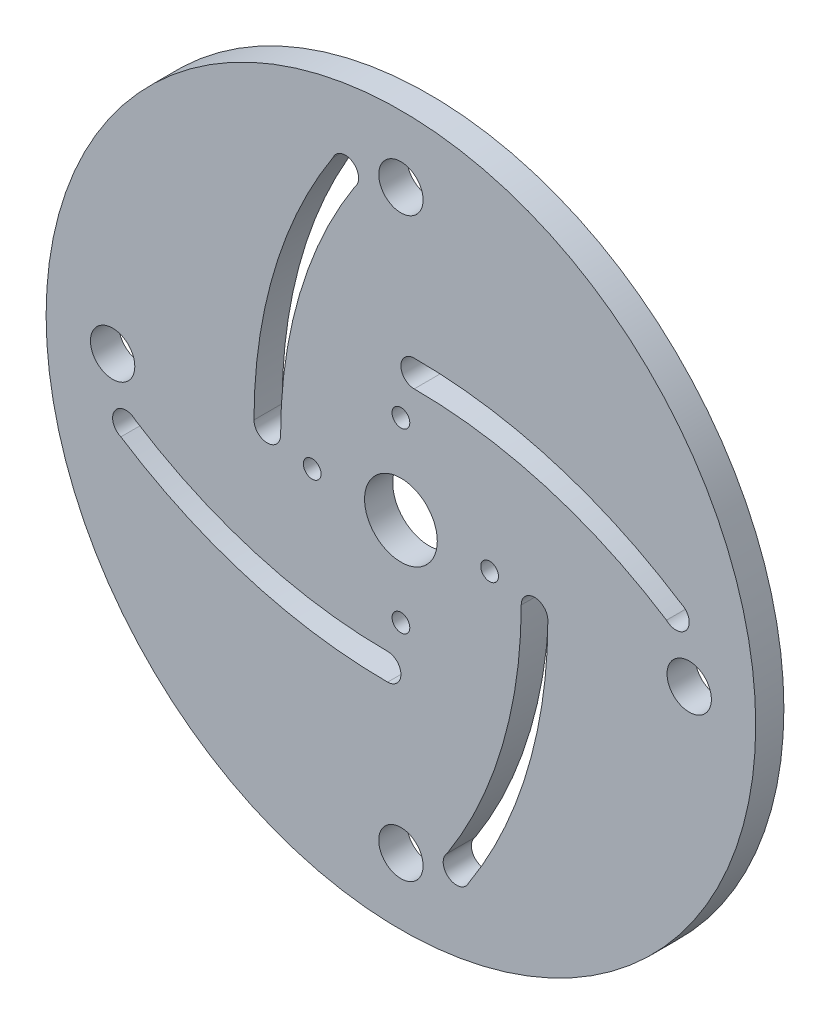
ISO-10303-21;
HEADER;
FILE_DESCRIPTION(('STEP AP214'),'2;1');
FILE_NAME('part.step','',(''),(''),'','','');
FILE_SCHEMA(('AUTOMOTIVE_DESIGN { 1 0 10303 214 1 1 1 1 }'));
ENDSEC;
DATA;
#1=APPLICATION_CONTEXT('core data for automotive mechanical design processes');
#2=APPLICATION_PROTOCOL_DEFINITION('international standard','automotive_design',2000,#1);
#3=PRODUCT_CONTEXT('',#1,'mechanical');
#4=PRODUCT('Part','Part','',(#3));
#5=PRODUCT_RELATED_PRODUCT_CATEGORY('part','',(#4));
#6=PRODUCT_DEFINITION_FORMATION('','',#4);
#7=PRODUCT_DEFINITION_CONTEXT('part definition',#1,'design');
#8=PRODUCT_DEFINITION('design','',#6,#7);
#9=PRODUCT_DEFINITION_SHAPE('','',#8);
#10=(LENGTH_UNIT() NAMED_UNIT(*) SI_UNIT(.MILLI.,.METRE.));
#11=(NAMED_UNIT(*) PLANE_ANGLE_UNIT() SI_UNIT($,.RADIAN.));
#12=(NAMED_UNIT(*) SI_UNIT($,.STERADIAN.) SOLID_ANGLE_UNIT());
#13=UNCERTAINTY_MEASURE_WITH_UNIT(LENGTH_MEASURE(1.E-05),#10,'distance_accuracy_value','');
#14=(GEOMETRIC_REPRESENTATION_CONTEXT(3) GLOBAL_UNCERTAINTY_ASSIGNED_CONTEXT((#13)) GLOBAL_UNIT_ASSIGNED_CONTEXT((#10,
#11,#12)) REPRESENTATION_CONTEXT('',''));
#15=CARTESIAN_POINT('',(0.,0.,0.));
#16=DIRECTION('',(0.,0.,1.));
#17=DIRECTION('',(1.,0.,0.));
#18=AXIS2_PLACEMENT_3D('',#15,#16,#17);
#19=CARTESIAN_POINT('',(0.,0.,3.175));
#20=DIRECTION('',(0.,0.,1.));
#21=DIRECTION('',(1.,0.,0.));
#22=AXIS2_PLACEMENT_3D('',#19,#20,#21);
#23=PLANE('',#22);
#24=CARTESIAN_POINT('',(-3.75211670479082E-13,-32.500000024,3.175));
#25=DIRECTION('',(0.,0.,1.));
#26=DIRECTION('',(1.,0.,0.));
#27=AXIS2_PLACEMENT_3D('',#24,#25,#26);
#28=CIRCLE('',#27,2.5);
#29=CARTESIAN_POINT('',(2.49999999999963,-32.500000024,3.175));
#30=VERTEX_POINT('',#29);
#31=EDGE_CURVE('E287',#30,#30,#28,.T.);
#32=ORIENTED_EDGE('',*,*,#31,.F.);
#33=EDGE_LOOP('',(#32));
#34=FACE_BOUND('',#33,.T.);
#35=CARTESIAN_POINT('',(0.,10.,3.175));
#36=DIRECTION('',(0.,0.,1.));
#37=DIRECTION('',(1.,0.,0.));
#38=AXIS2_PLACEMENT_3D('',#35,#36,#37);
#39=CIRCLE('',#38,1.);
#40=CARTESIAN_POINT('',(1.,10.,3.175));
#41=VERTEX_POINT('',#40);
#42=EDGE_CURVE('E299',#41,#41,#39,.T.);
#43=ORIENTED_EDGE('',*,*,#42,.F.);
#44=EDGE_LOOP('',(#43));
#45=FACE_BOUND('',#44,.T.);
#46=CARTESIAN_POINT('',(0.,-10.,3.175));
#47=DIRECTION('',(0.,0.,1.));
#48=DIRECTION('',(1.,0.,0.));
#49=AXIS2_PLACEMENT_3D('',#46,#47,#48);
#50=CIRCLE('',#49,1.);
#51=CARTESIAN_POINT('',(1.,-10.,3.175));
#52=VERTEX_POINT('',#51);
#53=EDGE_CURVE('E311',#52,#52,#50,.T.);
#54=ORIENTED_EDGE('',*,*,#53,.F.);
#55=EDGE_LOOP('',(#54));
#56=FACE_BOUND('',#55,.T.);
#57=CARTESIAN_POINT('',(10.,0.,3.175));
#58=DIRECTION('',(0.,0.,1.));
#59=DIRECTION('',(1.,0.,0.));
#60=AXIS2_PLACEMENT_3D('',#57,#58,#59);
#61=CIRCLE('',#60,1.);
#62=CARTESIAN_POINT('',(11.,0.,3.175));
#63=VERTEX_POINT('',#62);
#64=EDGE_CURVE('E323',#63,#63,#61,.T.);
#65=ORIENTED_EDGE('',*,*,#64,.F.);
#66=EDGE_LOOP('',(#65));
#67=FACE_BOUND('',#66,.T.);
#68=CARTESIAN_POINT('',(0.,0.,3.175));
#69=DIRECTION('',(0.,0.,1.));
#70=DIRECTION('',(1.,0.,0.));
#71=AXIS2_PLACEMENT_3D('',#68,#69,#70);
#72=CIRCLE('',#71,40.);
#73=CARTESIAN_POINT('',(40.,0.,3.175));
#74=VERTEX_POINT('',#73);
#75=EDGE_CURVE('E11',#74,#74,#72,.T.);
#76=ORIENTED_EDGE('',*,*,#75,.T.);
#77=EDGE_LOOP('',(#76));
#78=FACE_BOUND('',#77,.T.);
#79=CARTESIAN_POINT('',(0.,0.,3.175));
#80=DIRECTION('',(0.,0.,1.));
#81=DIRECTION('',(1.,0.,0.));
#82=AXIS2_PLACEMENT_3D('',#79,#80,#81);
#83=CIRCLE('',#82,4.1);
#84=CARTESIAN_POINT('',(4.1,0.,3.175));
#85=VERTEX_POINT('',#84);
#86=EDGE_CURVE('E329',#85,#85,#83,.T.);
#87=ORIENTED_EDGE('',*,*,#86,.F.);
#88=EDGE_LOOP('',(#87));
#89=FACE_BOUND('',#88,.T.);
#90=CARTESIAN_POINT('',(1.48265383286687E-13,32.500000024,3.175));
#91=DIRECTION('',(0.,0.,1.));
#92=DIRECTION('',(1.,0.,0.));
#93=AXIS2_PLACEMENT_3D('',#90,#91,#92);
#94=CIRCLE('',#93,2.5);
#95=CARTESIAN_POINT('',(2.50000000000015,32.500000024,3.175));
#96=VERTEX_POINT('',#95);
#97=EDGE_CURVE('E317',#96,#96,#94,.T.);
#98=ORIENTED_EDGE('',*,*,#97,.F.);
#99=EDGE_LOOP('',(#98));
#100=FACE_BOUND('',#99,.T.);
#101=CARTESIAN_POINT('',(-10.,0.,3.175));
#102=DIRECTION('',(0.,0.,1.));
#103=DIRECTION('',(1.,0.,0.));
#104=AXIS2_PLACEMENT_3D('',#101,#102,#103);
#105=CIRCLE('',#104,1.);
#106=CARTESIAN_POINT('',(-9.,0.,3.175));
#107=VERTEX_POINT('',#106);
#108=EDGE_CURVE('E305',#107,#107,#105,.T.);
#109=ORIENTED_EDGE('',*,*,#108,.F.);
#110=EDGE_LOOP('',(#109));
#111=FACE_BOUND('',#110,.T.);
#112=CARTESIAN_POINT('',(32.500000024,-2.68677420786791E-13,3.175));
#113=DIRECTION('',(0.,0.,1.));
#114=DIRECTION('',(1.,0.,0.));
#115=AXIS2_PLACEMENT_3D('',#112,#113,#114);
#116=CIRCLE('',#115,2.5);
#117=CARTESIAN_POINT('',(35.000000024,-2.68677420786791E-13,3.175));
#118=VERTEX_POINT('',#117);
#119=EDGE_CURVE('E293',#118,#118,#116,.T.);
#120=ORIENTED_EDGE('',*,*,#119,.F.);
#121=EDGE_LOOP('',(#120));
#122=FACE_BOUND('',#121,.T.);
#123=CARTESIAN_POINT('',(-32.500000024,4.88684814075279E-13,3.175));
#124=DIRECTION('',(0.,0.,1.));
#125=DIRECTION('',(1.,0.,0.));
#126=AXIS2_PLACEMENT_3D('',#123,#124,#125);
#127=CIRCLE('',#126,2.5);
#128=CARTESIAN_POINT('',(-30.000000024,4.88684814075279E-13,3.175));
#129=VERTEX_POINT('',#128);
#130=EDGE_CURVE('E281',#129,#129,#127,.T.);
#131=ORIENTED_EDGE('',*,*,#130,.F.);
#132=EDGE_LOOP('',(#131));
#133=FACE_BOUND('',#132,.T.);
#134=CARTESIAN_POINT('',(-39.0025216784097,-1.49999999999986,3.175));
#135=DIRECTION('',(0.,0.,-1.));
#136=DIRECTION('',(-1.,0.,0.));
#137=AXIS2_PLACEMENT_3D('',#134,#135,#136);
#138=CIRCLE('',#137,52.5665394608045);
#139=CARTESIAN_POINT('',(13.5640177823949,-1.50000000000004,3.175));
#140=VERTEX_POINT('',#139);
#141=CARTESIAN_POINT('',(5.20658394084292,-29.9393398522202,3.175));
#142=VERTEX_POINT('',#141);
#143=EDGE_CURVE('E252',#140,#142,#138,.T.);
#144=ORIENTED_EDGE('',*,*,#143,.F.);
#145=CARTESIAN_POINT('',(15.0640177823949,-1.50000000000005,3.175));
#146=DIRECTION('',(0.,0.,1.));
#147=DIRECTION('',(1.,0.,0.));
#148=AXIS2_PLACEMENT_3D('',#145,#146,#147);
#149=CIRCLE('',#148,1.5);
#150=CARTESIAN_POINT('',(16.5640177823949,-1.50000000000005,3.175));
#151=VERTEX_POINT('',#150);
#152=EDGE_CURVE('E250',#151,#140,#149,.T.);
#153=ORIENTED_EDGE('',*,*,#152,.F.);
#154=CARTESIAN_POINT('',(-38.6406245554937,-1.49999999999986,3.175));
#155=DIRECTION('',(0.,0.,1.));
#156=DIRECTION('',(-1.,0.,0.));
#157=AXIS2_PLACEMENT_3D('',#154,#155,#156);
#158=CIRCLE('',#157,55.2046423378886);
#159=CARTESIAN_POINT('',(7.65306341138967,-31.5740251725476,3.175));
#160=VERTEX_POINT('',#159);
#161=EDGE_CURVE('E258',#160,#151,#158,.T.);
#162=ORIENTED_EDGE('',*,*,#161,.F.);
#163=CARTESIAN_POINT('',(6.26724411262274,-31.000000024,3.175));
#164=DIRECTION('',(0.,0.,1.));
#165=DIRECTION('',(1.,0.,0.));
#166=AXIS2_PLACEMENT_3D('',#163,#164,#165);
#167=CIRCLE('',#166,1.5);
#168=EDGE_CURVE('E255',#142,#160,#167,.T.);
#169=ORIENTED_EDGE('',*,*,#168,.F.);
#170=EDGE_LOOP('',(#144,#153,#162,#169));
#171=FACE_BOUND('',#170,.T.);
#172=CARTESIAN_POINT('',(1.49999999999999,-39.0025216784097,3.175));
#173=DIRECTION('',(0.,0.,-1.));
#174=DIRECTION('',(-1.,0.,0.));
#175=AXIS2_PLACEMENT_3D('',#172,#173,#174);
#176=CIRCLE('',#175,52.5665394608045);
#177=CARTESIAN_POINT('',(1.49999999999999,13.5640177823949,3.175));
#178=VERTEX_POINT('',#177);
#179=CARTESIAN_POINT('',(29.9393398522202,5.20658394084302,3.175));
#180=VERTEX_POINT('',#179);
#181=EDGE_CURVE('E221',#178,#180,#176,.T.);
#182=ORIENTED_EDGE('',*,*,#181,.F.);
#183=CARTESIAN_POINT('',(1.5,15.0640177823949,3.175));
#184=DIRECTION('',(0.,0.,1.));
#185=DIRECTION('',(1.,0.,0.));
#186=AXIS2_PLACEMENT_3D('',#183,#184,#185);
#187=CIRCLE('',#186,1.5);
#188=CARTESIAN_POINT('',(1.49999999999999,16.5640177823949,3.175));
#189=VERTEX_POINT('',#188);
#190=EDGE_CURVE('E219',#189,#178,#187,.T.);
#191=ORIENTED_EDGE('',*,*,#190,.F.);
#192=CARTESIAN_POINT('',(1.49999999999999,-38.6406245554937,3.175));
#193=DIRECTION('',(0.,0.,1.));
#194=DIRECTION('',(-1.,0.,0.));
#195=AXIS2_PLACEMENT_3D('',#192,#193,#194);
#196=CIRCLE('',#195,55.2046423378886);
#197=CARTESIAN_POINT('',(31.5740251725476,7.65306341138978,3.175));
#198=VERTEX_POINT('',#197);
#199=EDGE_CURVE('E227',#198,#189,#196,.T.);
#200=ORIENTED_EDGE('',*,*,#199,.F.);
#201=CARTESIAN_POINT('',(31.000000024,6.26724411262285,3.175));
#202=DIRECTION('',(0.,0.,1.));
#203=DIRECTION('',(1.,0.,0.));
#204=AXIS2_PLACEMENT_3D('',#201,#202,#203);
#205=CIRCLE('',#204,1.5);
#206=EDGE_CURVE('E224',#180,#198,#205,.T.);
#207=ORIENTED_EDGE('',*,*,#206,.F.);
#208=EDGE_LOOP('',(#182,#191,#200,#207));
#209=FACE_BOUND('',#208,.T.);
#210=CARTESIAN_POINT('',(-1.49999999999972,39.0025216784097,3.175));
#211=DIRECTION('',(0.,0.,-1.));
#212=DIRECTION('',(-1.,0.,0.));
#213=AXIS2_PLACEMENT_3D('',#210,#211,#212);
#214=CIRCLE('',#213,52.5665394608045);
#215=CARTESIAN_POINT('',(-1.50000000000009,-13.5640177823949,3.175));
#216=VERTEX_POINT('',#215);
#217=CARTESIAN_POINT('',(-29.9393398522202,-5.20658394084281,3.175));
#218=VERTEX_POINT('',#217);
#219=EDGE_CURVE('E190',#216,#218,#214,.T.);
#220=ORIENTED_EDGE('',*,*,#219,.F.);
#221=CARTESIAN_POINT('',(-1.5000000000001,-15.0640177823949,3.175));
#222=DIRECTION('',(0.,0.,1.));
#223=DIRECTION('',(1.,0.,0.));
#224=AXIS2_PLACEMENT_3D('',#221,#222,#223);
#225=CIRCLE('',#224,1.5);
#226=CARTESIAN_POINT('',(-1.50000000000011,-16.5640177823949,3.175));
#227=VERTEX_POINT('',#226);
#228=EDGE_CURVE('E188',#227,#216,#225,.T.);
#229=ORIENTED_EDGE('',*,*,#228,.F.);
#230=CARTESIAN_POINT('',(-1.49999999999972,38.6406245554937,3.175));
#231=DIRECTION('',(0.,0.,1.));
#232=DIRECTION('',(-1.,0.,0.));
#233=AXIS2_PLACEMENT_3D('',#230,#231,#232);
#234=CIRCLE('',#233,55.2046423378886);
#235=CARTESIAN_POINT('',(-31.5740251725477,-7.65306341138955,3.175));
#236=VERTEX_POINT('',#235);
#237=EDGE_CURVE('E196',#236,#227,#234,.T.);
#238=ORIENTED_EDGE('',*,*,#237,.F.);
#239=CARTESIAN_POINT('',(-31.000000024,-6.26724411262263,3.175));
#240=DIRECTION('',(0.,0.,1.));
#241=DIRECTION('',(1.,0.,0.));
#242=AXIS2_PLACEMENT_3D('',#239,#240,#241);
#243=CIRCLE('',#242,1.5);
#244=EDGE_CURVE('E193',#218,#236,#243,.T.);
#245=ORIENTED_EDGE('',*,*,#244,.F.);
#246=EDGE_LOOP('',(#220,#229,#238,#245));
#247=FACE_BOUND('',#246,.T.);
#248=CARTESIAN_POINT('',(39.0025216784097,1.49999999999959,3.175));
#249=DIRECTION('',(0.,0.,-1.));
#250=DIRECTION('',(-1.,0.,0.));
#251=AXIS2_PLACEMENT_3D('',#248,#249,#250);
#252=CIRCLE('',#251,52.5665394608045);
#253=CARTESIAN_POINT('',(-13.5640177823948,1.50000000000014,3.175));
#254=VERTEX_POINT('',#253);
#255=CARTESIAN_POINT('',(-5.20658394084271,29.9393398522202,3.175));
#256=VERTEX_POINT('',#255);
#257=EDGE_CURVE('E160',#254,#256,#252,.T.);
#258=ORIENTED_EDGE('',*,*,#257,.F.);
#259=CARTESIAN_POINT('',(-15.0640177823949,1.50000000000015,3.175));
#260=DIRECTION('',(0.,0.,1.));
#261=DIRECTION('',(1.,0.,0.));
#262=AXIS2_PLACEMENT_3D('',#259,#260,#261);
#263=CIRCLE('',#262,1.5);
#264=CARTESIAN_POINT('',(-16.5640177823949,1.50000000000017,3.175));
#265=VERTEX_POINT('',#264);
#266=EDGE_CURVE('E152',#265,#254,#263,.T.);
#267=ORIENTED_EDGE('',*,*,#266,.F.);
#268=CARTESIAN_POINT('',(38.6406245554937,1.49999999999959,3.175));
#269=DIRECTION('',(0.,0.,1.));
#270=DIRECTION('',(-1.,0.,0.));
#271=AXIS2_PLACEMENT_3D('',#268,#269,#270);
#272=CIRCLE('',#271,55.2046423378886);
#273=CARTESIAN_POINT('',(-7.65306341138944,31.5740251725477,3.175));
#274=VERTEX_POINT('',#273);
#275=EDGE_CURVE('E174',#274,#265,#272,.T.);
#276=ORIENTED_EDGE('',*,*,#275,.F.);
#277=CARTESIAN_POINT('',(-6.26724411262253,31.0000000240001,3.175));
#278=DIRECTION('',(0.,0.,1.));
#279=DIRECTION('',(1.,0.,0.));
#280=AXIS2_PLACEMENT_3D('',#277,#278,#279);
#281=CIRCLE('',#280,1.5);
#282=EDGE_CURVE('E172',#256,#274,#281,.T.);
#283=ORIENTED_EDGE('',*,*,#282,.F.);
#284=EDGE_LOOP('',(#258,#267,#276,#283));
#285=FACE_BOUND('',#284,.T.);
#286=ADVANCED_FACE('F39',(#34,#45,#56,#67,#78,#89,#100,#111,#122,#133,#171,#209,#247,#285),#23,.T.);
#287=CARTESIAN_POINT('',(0.,0.,0.));
#288=DIRECTION('',(0.,0.,1.));
#289=DIRECTION('',(1.,0.,0.));
#290=AXIS2_PLACEMENT_3D('',#287,#288,#289);
#291=PLANE('',#290);
#292=CARTESIAN_POINT('',(-1.5000000000001,-15.0640177823949,0.));
#293=DIRECTION('',(0.,0.,1.));
#294=DIRECTION('',(1.,0.,0.));
#295=AXIS2_PLACEMENT_3D('',#292,#293,#294);
#296=CIRCLE('',#295,1.5);
#297=CARTESIAN_POINT('',(-1.50000000000011,-16.5640177823949,0.));
#298=VERTEX_POINT('',#297);
#299=CARTESIAN_POINT('',(-1.50000000000009,-13.5640177823949,0.));
#300=VERTEX_POINT('',#299);
#301=EDGE_CURVE('E168',#298,#300,#296,.T.);
#302=ORIENTED_EDGE('',*,*,#301,.T.);
#303=CARTESIAN_POINT('',(-1.49999999999972,39.0025216784097,0.));
#304=DIRECTION('',(0.,0.,-1.));
#305=DIRECTION('',(-1.,0.,0.));
#306=AXIS2_PLACEMENT_3D('',#303,#304,#305);
#307=CIRCLE('',#306,52.5665394608045);
#308=CARTESIAN_POINT('',(-29.9393398522202,-5.20658394084281,0.));
#309=VERTEX_POINT('',#308);
#310=EDGE_CURVE('E201',#300,#309,#307,.T.);
#311=ORIENTED_EDGE('',*,*,#310,.T.);
#312=CARTESIAN_POINT('',(-31.000000024,-6.26724411262263,0.));
#313=DIRECTION('',(0.,0.,1.));
#314=DIRECTION('',(1.,0.,0.));
#315=AXIS2_PLACEMENT_3D('',#312,#313,#314);
#316=CIRCLE('',#315,1.5);
#317=CARTESIAN_POINT('',(-31.5740251725477,-7.65306341138956,0.));
#318=VERTEX_POINT('',#317);
#319=EDGE_CURVE('E204',#309,#318,#316,.T.);
#320=ORIENTED_EDGE('',*,*,#319,.T.);
#321=CARTESIAN_POINT('',(-1.49999999999972,38.6406245554937,0.));
#322=DIRECTION('',(0.,0.,1.));
#323=DIRECTION('',(-1.,0.,0.));
#324=AXIS2_PLACEMENT_3D('',#321,#322,#323);
#325=CIRCLE('',#324,55.2046423378886);
#326=EDGE_CURVE('E191',#318,#298,#325,.T.);
#327=ORIENTED_EDGE('',*,*,#326,.T.);
#328=EDGE_LOOP('',(#302,#311,#320,#327));
#329=FACE_BOUND('',#328,.T.);
#330=CARTESIAN_POINT('',(15.0640177823949,-1.50000000000005,0.));
#331=DIRECTION('',(0.,0.,1.));
#332=DIRECTION('',(1.,0.,0.));
#333=AXIS2_PLACEMENT_3D('',#330,#331,#332);
#334=CIRCLE('',#333,1.5);
#335=CARTESIAN_POINT('',(16.5640177823949,-1.49999999999986,0.));
#336=VERTEX_POINT('',#335);
#337=CARTESIAN_POINT('',(13.5640177823949,-1.50000000000004,0.));
#338=VERTEX_POINT('',#337);
#339=EDGE_CURVE('E249',#336,#338,#334,.T.);
#340=ORIENTED_EDGE('',*,*,#339,.T.);
#341=CARTESIAN_POINT('',(-39.0025216784097,-1.49999999999986,0.));
#342=DIRECTION('',(0.,0.,-1.));
#343=DIRECTION('',(-1.,0.,0.));
#344=AXIS2_PLACEMENT_3D('',#341,#342,#343);
#345=CIRCLE('',#344,52.5665394608045);
#346=CARTESIAN_POINT('',(5.20658394084292,-29.9393398522202,0.));
#347=VERTEX_POINT('',#346);
#348=EDGE_CURVE('E263',#338,#347,#345,.T.);
#349=ORIENTED_EDGE('',*,*,#348,.T.);
#350=CARTESIAN_POINT('',(6.26724411262274,-31.000000024,0.));
#351=DIRECTION('',(0.,0.,1.));
#352=DIRECTION('',(1.,0.,0.));
#353=AXIS2_PLACEMENT_3D('',#350,#351,#352);
#354=CIRCLE('',#353,1.5);
#355=CARTESIAN_POINT('',(7.65306341138967,-31.5740251725476,0.));
#356=VERTEX_POINT('',#355);
#357=EDGE_CURVE('E266',#347,#356,#354,.T.);
#358=ORIENTED_EDGE('',*,*,#357,.T.);
#359=CARTESIAN_POINT('',(-38.6406245554937,-1.49999999999986,0.));
#360=DIRECTION('',(0.,0.,1.));
#361=DIRECTION('',(-1.,0.,0.));
#362=AXIS2_PLACEMENT_3D('',#359,#360,#361);
#363=CIRCLE('',#362,55.2046423378886);
#364=EDGE_CURVE('E253',#356,#336,#363,.T.);
#365=ORIENTED_EDGE('',*,*,#364,.T.);
#366=EDGE_LOOP('',(#340,#349,#358,#365));
#367=FACE_BOUND('',#366,.T.);
#368=CARTESIAN_POINT('',(0.,0.,0.));
#369=DIRECTION('',(0.,0.,1.));
#370=DIRECTION('',(1.,0.,0.));
#371=AXIS2_PLACEMENT_3D('',#368,#369,#370);
#372=CIRCLE('',#371,40.);
#373=CARTESIAN_POINT('',(40.,0.,0.));
#374=VERTEX_POINT('',#373);
#375=EDGE_CURVE('E43',#374,#374,#372,.T.);
#376=ORIENTED_EDGE('',*,*,#375,.F.);
#377=EDGE_LOOP('',(#376));
#378=FACE_BOUND('',#377,.T.);
#379=CARTESIAN_POINT('',(0.,0.,0.));
#380=DIRECTION('',(0.,0.,1.));
#381=DIRECTION('',(1.,0.,0.));
#382=AXIS2_PLACEMENT_3D('',#379,#380,#381);
#383=CIRCLE('',#382,4.1);
#384=CARTESIAN_POINT('',(4.1,0.,0.));
#385=VERTEX_POINT('',#384);
#386=EDGE_CURVE('E326',#385,#385,#383,.T.);
#387=ORIENTED_EDGE('',*,*,#386,.T.);
#388=EDGE_LOOP('',(#387));
#389=FACE_BOUND('',#388,.T.);
#390=CARTESIAN_POINT('',(10.,0.,0.));
#391=DIRECTION('',(0.,0.,1.));
#392=DIRECTION('',(1.,0.,0.));
#393=AXIS2_PLACEMENT_3D('',#390,#391,#392);
#394=CIRCLE('',#393,1.);
#395=CARTESIAN_POINT('',(11.,0.,0.));
#396=VERTEX_POINT('',#395);
#397=EDGE_CURVE('E320',#396,#396,#394,.T.);
#398=ORIENTED_EDGE('',*,*,#397,.T.);
#399=EDGE_LOOP('',(#398));
#400=FACE_BOUND('',#399,.T.);
#401=CARTESIAN_POINT('',(1.48265383286687E-13,32.500000024,0.));
#402=DIRECTION('',(0.,0.,1.));
#403=DIRECTION('',(1.,0.,0.));
#404=AXIS2_PLACEMENT_3D('',#401,#402,#403);
#405=CIRCLE('',#404,2.5);
#406=CARTESIAN_POINT('',(2.50000000000015,32.500000024,0.));
#407=VERTEX_POINT('',#406);
#408=EDGE_CURVE('E314',#407,#407,#405,.T.);
#409=ORIENTED_EDGE('',*,*,#408,.T.);
#410=EDGE_LOOP('',(#409));
#411=FACE_BOUND('',#410,.T.);
#412=CARTESIAN_POINT('',(0.,-10.,0.));
#413=DIRECTION('',(0.,0.,1.));
#414=DIRECTION('',(1.,0.,0.));
#415=AXIS2_PLACEMENT_3D('',#412,#413,#414);
#416=CIRCLE('',#415,1.);
#417=CARTESIAN_POINT('',(1.,-10.,0.));
#418=VERTEX_POINT('',#417);
#419=EDGE_CURVE('E308',#418,#418,#416,.T.);
#420=ORIENTED_EDGE('',*,*,#419,.T.);
#421=EDGE_LOOP('',(#420));
#422=FACE_BOUND('',#421,.T.);
#423=CARTESIAN_POINT('',(-10.,0.,0.));
#424=DIRECTION('',(0.,0.,1.));
#425=DIRECTION('',(1.,0.,0.));
#426=AXIS2_PLACEMENT_3D('',#423,#424,#425);
#427=CIRCLE('',#426,1.);
#428=CARTESIAN_POINT('',(-9.,0.,0.));
#429=VERTEX_POINT('',#428);
#430=EDGE_CURVE('E302',#429,#429,#427,.T.);
#431=ORIENTED_EDGE('',*,*,#430,.T.);
#432=EDGE_LOOP('',(#431));
#433=FACE_BOUND('',#432,.T.);
#434=CARTESIAN_POINT('',(0.,10.,0.));
#435=DIRECTION('',(0.,0.,1.));
#436=DIRECTION('',(1.,0.,0.));
#437=AXIS2_PLACEMENT_3D('',#434,#435,#436);
#438=CIRCLE('',#437,1.);
#439=CARTESIAN_POINT('',(1.,10.,0.));
#440=VERTEX_POINT('',#439);
#441=EDGE_CURVE('E296',#440,#440,#438,.T.);
#442=ORIENTED_EDGE('',*,*,#441,.T.);
#443=EDGE_LOOP('',(#442));
#444=FACE_BOUND('',#443,.T.);
#445=CARTESIAN_POINT('',(32.500000024,-2.68677420786791E-13,0.));
#446=DIRECTION('',(0.,0.,1.));
#447=DIRECTION('',(1.,0.,0.));
#448=AXIS2_PLACEMENT_3D('',#445,#446,#447);
#449=CIRCLE('',#448,2.5);
#450=CARTESIAN_POINT('',(35.000000024,-2.68677420786791E-13,0.));
#451=VERTEX_POINT('',#450);
#452=EDGE_CURVE('E290',#451,#451,#449,.T.);
#453=ORIENTED_EDGE('',*,*,#452,.T.);
#454=EDGE_LOOP('',(#453));
#455=FACE_BOUND('',#454,.T.);
#456=CARTESIAN_POINT('',(-3.75211670479082E-13,-32.500000024,0.));
#457=DIRECTION('',(0.,0.,1.));
#458=DIRECTION('',(1.,0.,0.));
#459=AXIS2_PLACEMENT_3D('',#456,#457,#458);
#460=CIRCLE('',#459,2.5);
#461=CARTESIAN_POINT('',(2.49999999999963,-32.500000024,0.));
#462=VERTEX_POINT('',#461);
#463=EDGE_CURVE('E284',#462,#462,#460,.T.);
#464=ORIENTED_EDGE('',*,*,#463,.T.);
#465=EDGE_LOOP('',(#464));
#466=FACE_BOUND('',#465,.T.);
#467=CARTESIAN_POINT('',(-32.500000024,4.88684814075279E-13,0.));
#468=DIRECTION('',(0.,0.,1.));
#469=DIRECTION('',(1.,0.,0.));
#470=AXIS2_PLACEMENT_3D('',#467,#468,#469);
#471=CIRCLE('',#470,2.5);
#472=CARTESIAN_POINT('',(-30.000000024,4.88684814075279E-13,0.));
#473=VERTEX_POINT('',#472);
#474=EDGE_CURVE('E280',#473,#473,#471,.T.);
#475=ORIENTED_EDGE('',*,*,#474,.T.);
#476=EDGE_LOOP('',(#475));
#477=FACE_BOUND('',#476,.T.);
#478=CARTESIAN_POINT('',(1.5,15.0640177823949,0.));
#479=DIRECTION('',(0.,0.,1.));
#480=DIRECTION('',(1.,0.,0.));
#481=AXIS2_PLACEMENT_3D('',#478,#479,#480);
#482=CIRCLE('',#481,1.5);
#483=CARTESIAN_POINT('',(1.49999999999999,16.5640177823949,0.));
#484=VERTEX_POINT('',#483);
#485=CARTESIAN_POINT('',(1.49999999999999,13.5640177823949,0.));
#486=VERTEX_POINT('',#485);
#487=EDGE_CURVE('E218',#484,#486,#482,.T.);
#488=ORIENTED_EDGE('',*,*,#487,.T.);
#489=CARTESIAN_POINT('',(1.49999999999999,-39.0025216784097,0.));
#490=DIRECTION('',(0.,0.,-1.));
#491=DIRECTION('',(-1.,0.,0.));
#492=AXIS2_PLACEMENT_3D('',#489,#490,#491);
#493=CIRCLE('',#492,52.5665394608045);
#494=CARTESIAN_POINT('',(29.9393398522202,5.20658394084302,0.));
#495=VERTEX_POINT('',#494);
#496=EDGE_CURVE('E232',#486,#495,#493,.T.);
#497=ORIENTED_EDGE('',*,*,#496,.T.);
#498=CARTESIAN_POINT('',(31.000000024,6.26724411262285,0.));
#499=DIRECTION('',(0.,0.,1.));
#500=DIRECTION('',(1.,0.,0.));
#501=AXIS2_PLACEMENT_3D('',#498,#499,#500);
#502=CIRCLE('',#501,1.5);
#503=CARTESIAN_POINT('',(31.5740251725476,7.65306341138978,0.));
#504=VERTEX_POINT('',#503);
#505=EDGE_CURVE('E235',#495,#504,#502,.T.);
#506=ORIENTED_EDGE('',*,*,#505,.T.);
#507=CARTESIAN_POINT('',(1.49999999999999,-38.6406245554937,0.));
#508=DIRECTION('',(0.,0.,1.));
#509=DIRECTION('',(-1.,0.,0.));
#510=AXIS2_PLACEMENT_3D('',#507,#508,#509);
#511=CIRCLE('',#510,55.2046423378886);
#512=EDGE_CURVE('E222',#504,#484,#511,.T.);
#513=ORIENTED_EDGE('',*,*,#512,.T.);
#514=EDGE_LOOP('',(#488,#497,#506,#513));
#515=FACE_BOUND('',#514,.T.);
#516=CARTESIAN_POINT('',(-15.0640177823949,1.50000000000015,0.));
#517=DIRECTION('',(0.,0.,1.));
#518=DIRECTION('',(1.,0.,0.));
#519=AXIS2_PLACEMENT_3D('',#516,#517,#518);
#520=CIRCLE('',#519,1.5);
#521=CARTESIAN_POINT('',(-16.5640177823949,1.50000000000017,0.));
#522=VERTEX_POINT('',#521);
#523=CARTESIAN_POINT('',(-13.5640177823948,1.50000000000014,0.));
#524=VERTEX_POINT('',#523);
#525=EDGE_CURVE('E62',#522,#524,#520,.T.);
#526=ORIENTED_EDGE('',*,*,#525,.T.);
#527=CARTESIAN_POINT('',(39.0025216784097,1.49999999999959,0.));
#528=DIRECTION('',(0.,0.,-1.));
#529=DIRECTION('',(-1.,0.,0.));
#530=AXIS2_PLACEMENT_3D('',#527,#528,#529);
#531=CIRCLE('',#530,52.5665394608045);
#532=CARTESIAN_POINT('',(-5.20658394084271,29.9393398522202,0.));
#533=VERTEX_POINT('',#532);
#534=EDGE_CURVE('E167',#524,#533,#531,.T.);
#535=ORIENTED_EDGE('',*,*,#534,.T.);
#536=CARTESIAN_POINT('',(-6.26724411262253,31.0000000240001,0.));
#537=DIRECTION('',(0.,0.,1.));
#538=DIRECTION('',(1.,0.,0.));
#539=AXIS2_PLACEMENT_3D('',#536,#537,#538);
#540=CIRCLE('',#539,1.5);
#541=CARTESIAN_POINT('',(-7.65306341138944,31.5740251725477,0.));
#542=VERTEX_POINT('',#541);
#543=EDGE_CURVE('E180',#533,#542,#540,.T.);
#544=ORIENTED_EDGE('',*,*,#543,.T.);
#545=CARTESIAN_POINT('',(38.6406245554937,1.49999999999959,0.));
#546=DIRECTION('',(0.,0.,1.));
#547=DIRECTION('',(-1.,0.,0.));
#548=AXIS2_PLACEMENT_3D('',#545,#546,#547);
#549=CIRCLE('',#548,55.2046423378886);
#550=EDGE_CURVE('E161',#542,#522,#549,.T.);
#551=ORIENTED_EDGE('',*,*,#550,.T.);
#552=EDGE_LOOP('',(#526,#535,#544,#551));
#553=FACE_BOUND('',#552,.T.);
#554=ADVANCED_FACE('F335',(#329,#367,#378,#389,#400,#411,#422,#433,#444,#455,#466,#477,#515,
#553),#291,.F.);
#555=CARTESIAN_POINT('',(0.,0.,3.175));
#556=DIRECTION('',(0.,0.,-1.));
#557=DIRECTION('',(-1.,0.,0.));
#558=AXIS2_PLACEMENT_3D('',#555,#556,#557);
#559=CYLINDRICAL_SURFACE('',#558,40.);
#560=ORIENTED_EDGE('',*,*,#75,.F.);
#561=EDGE_LOOP('',(#560));
#562=FACE_BOUND('',#561,.T.);
#563=ORIENTED_EDGE('',*,*,#375,.T.);
#564=EDGE_LOOP('',(#563));
#565=FACE_BOUND('',#564,.T.);
#566=ADVANCED_FACE('F41',(#562,#565),#559,.T.);
#567=CARTESIAN_POINT('',(0.,0.,3.175));
#568=DIRECTION('',(0.,0.,-1.));
#569=DIRECTION('',(-1.,0.,0.));
#570=AXIS2_PLACEMENT_3D('',#567,#568,#569);
#571=CYLINDRICAL_SURFACE('',#570,4.1);
#572=ORIENTED_EDGE('',*,*,#86,.T.);
#573=EDGE_LOOP('',(#572));
#574=FACE_BOUND('',#573,.T.);
#575=ORIENTED_EDGE('',*,*,#386,.F.);
#576=EDGE_LOOP('',(#575));
#577=FACE_BOUND('',#576,.T.);
#578=ADVANCED_FACE('F338',(#574,#577),#571,.F.);
#579=CARTESIAN_POINT('',(10.,0.,3.175));
#580=DIRECTION('',(0.,0.,-1.));
#581=DIRECTION('',(-1.,0.,0.));
#582=AXIS2_PLACEMENT_3D('',#579,#580,#581);
#583=CYLINDRICAL_SURFACE('',#582,1.);
#584=ORIENTED_EDGE('',*,*,#64,.T.);
#585=EDGE_LOOP('',(#584));
#586=FACE_BOUND('',#585,.T.);
#587=ORIENTED_EDGE('',*,*,#397,.F.);
#588=EDGE_LOOP('',(#587));
#589=FACE_BOUND('',#588,.T.);
#590=ADVANCED_FACE('F340',(#586,#589),#583,.F.);
#591=CARTESIAN_POINT('',(1.48265383286687E-13,32.500000024,3.175));
#592=DIRECTION('',(0.,0.,-1.));
#593=DIRECTION('',(-1.,0.,0.));
#594=AXIS2_PLACEMENT_3D('',#591,#592,#593);
#595=CYLINDRICAL_SURFACE('',#594,2.5);
#596=ORIENTED_EDGE('',*,*,#97,.T.);
#597=EDGE_LOOP('',(#596));
#598=FACE_BOUND('',#597,.T.);
#599=ORIENTED_EDGE('',*,*,#408,.F.);
#600=EDGE_LOOP('',(#599));
#601=FACE_BOUND('',#600,.T.);
#602=ADVANCED_FACE('F347',(#598,#601),#595,.F.);
#603=CARTESIAN_POINT('',(0.,-10.,3.175));
#604=DIRECTION('',(0.,0.,-1.));
#605=DIRECTION('',(-1.,0.,0.));
#606=AXIS2_PLACEMENT_3D('',#603,#604,#605);
#607=CYLINDRICAL_SURFACE('',#606,1.);
#608=ORIENTED_EDGE('',*,*,#53,.T.);
#609=EDGE_LOOP('',(#608));
#610=FACE_BOUND('',#609,.T.);
#611=ORIENTED_EDGE('',*,*,#419,.F.);
#612=EDGE_LOOP('',(#611));
#613=FACE_BOUND('',#612,.T.);
#614=ADVANCED_FACE('F469',(#610,#613),#607,.F.);
#615=CARTESIAN_POINT('',(-10.,0.,3.175));
#616=DIRECTION('',(0.,0.,-1.));
#617=DIRECTION('',(-1.,0.,0.));
#618=AXIS2_PLACEMENT_3D('',#615,#616,#617);
#619=CYLINDRICAL_SURFACE('',#618,1.);
#620=ORIENTED_EDGE('',*,*,#108,.T.);
#621=EDGE_LOOP('',(#620));
#622=FACE_BOUND('',#621,.T.);
#623=ORIENTED_EDGE('',*,*,#430,.F.);
#624=EDGE_LOOP('',(#623));
#625=FACE_BOUND('',#624,.T.);
#626=ADVANCED_FACE('F465',(#622,#625),#619,.F.);
#627=CARTESIAN_POINT('',(0.,10.,3.175));
#628=DIRECTION('',(0.,0.,-1.));
#629=DIRECTION('',(-1.,0.,0.));
#630=AXIS2_PLACEMENT_3D('',#627,#628,#629);
#631=CYLINDRICAL_SURFACE('',#630,1.);
#632=ORIENTED_EDGE('',*,*,#42,.T.);
#633=EDGE_LOOP('',(#632));
#634=FACE_BOUND('',#633,.T.);
#635=ORIENTED_EDGE('',*,*,#441,.F.);
#636=EDGE_LOOP('',(#635));
#637=FACE_BOUND('',#636,.T.);
#638=ADVANCED_FACE('F461',(#634,#637),#631,.F.);
#639=CARTESIAN_POINT('',(32.500000024,-2.68677420786791E-13,3.175));
#640=DIRECTION('',(0.,0.,-1.));
#641=DIRECTION('',(-1.,0.,0.));
#642=AXIS2_PLACEMENT_3D('',#639,#640,#641);
#643=CYLINDRICAL_SURFACE('',#642,2.5);
#644=ORIENTED_EDGE('',*,*,#119,.T.);
#645=EDGE_LOOP('',(#644));
#646=FACE_BOUND('',#645,.T.);
#647=ORIENTED_EDGE('',*,*,#452,.F.);
#648=EDGE_LOOP('',(#647));
#649=FACE_BOUND('',#648,.T.);
#650=ADVANCED_FACE('F457',(#646,#649),#643,.F.);
#651=CARTESIAN_POINT('',(-3.75211670479082E-13,-32.500000024,3.175));
#652=DIRECTION('',(0.,0.,-1.));
#653=DIRECTION('',(-1.,0.,0.));
#654=AXIS2_PLACEMENT_3D('',#651,#652,#653);
#655=CYLINDRICAL_SURFACE('',#654,2.5);
#656=ORIENTED_EDGE('',*,*,#31,.T.);
#657=EDGE_LOOP('',(#656));
#658=FACE_BOUND('',#657,.T.);
#659=ORIENTED_EDGE('',*,*,#463,.F.);
#660=EDGE_LOOP('',(#659));
#661=FACE_BOUND('',#660,.T.);
#662=ADVANCED_FACE('F453',(#658,#661),#655,.F.);
#663=CARTESIAN_POINT('',(-32.500000024,4.88684814075279E-13,3.175));
#664=DIRECTION('',(0.,0.,-1.));
#665=DIRECTION('',(-1.,0.,0.));
#666=AXIS2_PLACEMENT_3D('',#663,#664,#665);
#667=CYLINDRICAL_SURFACE('',#666,2.5);
#668=ORIENTED_EDGE('',*,*,#130,.T.);
#669=EDGE_LOOP('',(#668));
#670=FACE_BOUND('',#669,.T.);
#671=ORIENTED_EDGE('',*,*,#474,.F.);
#672=EDGE_LOOP('',(#671));
#673=FACE_BOUND('',#672,.T.);
#674=ADVANCED_FACE('F449',(#670,#673),#667,.F.);
#675=CARTESIAN_POINT('',(15.0640177823949,-1.50000000000005,3.175));
#676=DIRECTION('',(0.,0.,-1.));
#677=DIRECTION('',(-1.,0.,0.));
#678=AXIS2_PLACEMENT_3D('',#675,#676,#677);
#679=CYLINDRICAL_SURFACE('',#678,1.5);
#680=ORIENTED_EDGE('',*,*,#339,.F.);
#681=DIRECTION('',(0.,0.,-1.));
#682=VECTOR('',#681,1.);
#683=CARTESIAN_POINT('',(16.5640177823949,-1.50000000000005,3.175));
#684=LINE('',#683,#682);
#685=EDGE_CURVE('E260',#151,#336,#684,.T.);
#686=ORIENTED_EDGE('',*,*,#685,.F.);
#687=ORIENTED_EDGE('',*,*,#152,.T.);
#688=DIRECTION('',(0.,0.,-1.));
#689=VECTOR('',#688,1.);
#690=CARTESIAN_POINT('',(13.5640177823949,-1.50000000000004,3.175));
#691=LINE('',#690,#689);
#692=EDGE_CURVE('E277',#140,#338,#691,.T.);
#693=ORIENTED_EDGE('',*,*,#692,.T.);
#694=EDGE_LOOP('',(#680,#686,#687,#693));
#695=FACE_BOUND('',#694,.T.);
#696=ADVANCED_FACE('F445',(#695),#679,.F.);
#697=CARTESIAN_POINT('',(-39.0025216784097,-1.49999999999986,3.175));
#698=DIRECTION('',(0.,0.,-1.));
#699=DIRECTION('',(-1.,0.,0.));
#700=AXIS2_PLACEMENT_3D('',#697,#698,#699);
#701=CYLINDRICAL_SURFACE('',#700,52.5665394608045);
#702=ORIENTED_EDGE('',*,*,#348,.F.);
#703=ORIENTED_EDGE('',*,*,#692,.F.);
#704=ORIENTED_EDGE('',*,*,#143,.T.);
#705=DIRECTION('',(0.,0.,-1.));
#706=VECTOR('',#705,1.);
#707=CARTESIAN_POINT('',(5.20658394084292,-29.9393398522202,3.175));
#708=LINE('',#707,#706);
#709=EDGE_CURVE('E275',#142,#347,#708,.T.);
#710=ORIENTED_EDGE('',*,*,#709,.T.);
#711=EDGE_LOOP('',(#702,#703,#704,#710));
#712=FACE_BOUND('',#711,.T.);
#713=ADVANCED_FACE('F441',(#712),#701,.T.);
#714=CARTESIAN_POINT('',(6.26724411262274,-31.000000024,3.175));
#715=DIRECTION('',(0.,0.,-1.));
#716=DIRECTION('',(-1.,0.,0.));
#717=AXIS2_PLACEMENT_3D('',#714,#715,#716);
#718=CYLINDRICAL_SURFACE('',#717,1.5);
#719=ORIENTED_EDGE('',*,*,#357,.F.);
#720=ORIENTED_EDGE('',*,*,#709,.F.);
#721=ORIENTED_EDGE('',*,*,#168,.T.);
#722=DIRECTION('',(0.,0.,-1.));
#723=VECTOR('',#722,1.);
#724=CARTESIAN_POINT('',(7.65306341138967,-31.5740251725476,3.175));
#725=LINE('',#724,#723);
#726=EDGE_CURVE('E273',#160,#356,#725,.T.);
#727=ORIENTED_EDGE('',*,*,#726,.T.);
#728=EDGE_LOOP('',(#719,#720,#721,#727));
#729=FACE_BOUND('',#728,.T.);
#730=ADVANCED_FACE('F437',(#729),#718,.F.);
#731=CARTESIAN_POINT('',(-38.6406245554937,-1.49999999999986,3.175));
#732=DIRECTION('',(0.,0.,-1.));
#733=DIRECTION('',(-1.,0.,0.));
#734=AXIS2_PLACEMENT_3D('',#731,#732,#733);
#735=CYLINDRICAL_SURFACE('',#734,55.2046423378886);
#736=ORIENTED_EDGE('',*,*,#364,.F.);
#737=ORIENTED_EDGE('',*,*,#726,.F.);
#738=ORIENTED_EDGE('',*,*,#161,.T.);
#739=ORIENTED_EDGE('',*,*,#685,.T.);
#740=EDGE_LOOP('',(#736,#737,#738,#739));
#741=FACE_BOUND('',#740,.T.);
#742=ADVANCED_FACE('F433',(#741),#735,.F.);
#743=CARTESIAN_POINT('',(1.5,15.0640177823949,3.175));
#744=DIRECTION('',(0.,0.,-1.));
#745=DIRECTION('',(-1.,0.,0.));
#746=AXIS2_PLACEMENT_3D('',#743,#744,#745);
#747=CYLINDRICAL_SURFACE('',#746,1.5);
#748=ORIENTED_EDGE('',*,*,#487,.F.);
#749=DIRECTION('',(0.,0.,-1.));
#750=VECTOR('',#749,1.);
#751=CARTESIAN_POINT('',(1.49999999999999,16.5640177823949,3.175));
#752=LINE('',#751,#750);
#753=EDGE_CURVE('E229',#189,#484,#752,.T.);
#754=ORIENTED_EDGE('',*,*,#753,.F.);
#755=ORIENTED_EDGE('',*,*,#190,.T.);
#756=DIRECTION('',(0.,0.,-1.));
#757=VECTOR('',#756,1.);
#758=CARTESIAN_POINT('',(1.49999999999999,13.5640177823949,3.175));
#759=LINE('',#758,#757);
#760=EDGE_CURVE('E246',#178,#486,#759,.T.);
#761=ORIENTED_EDGE('',*,*,#760,.T.);
#762=EDGE_LOOP('',(#748,#754,#755,#761));
#763=FACE_BOUND('',#762,.T.);
#764=ADVANCED_FACE('F429',(#763),#747,.F.);
#765=CARTESIAN_POINT('',(1.49999999999999,-39.0025216784097,3.175));
#766=DIRECTION('',(0.,0.,-1.));
#767=DIRECTION('',(-1.,0.,0.));
#768=AXIS2_PLACEMENT_3D('',#765,#766,#767);
#769=CYLINDRICAL_SURFACE('',#768,52.5665394608045);
#770=ORIENTED_EDGE('',*,*,#496,.F.);
#771=ORIENTED_EDGE('',*,*,#760,.F.);
#772=ORIENTED_EDGE('',*,*,#181,.T.);
#773=DIRECTION('',(0.,0.,-1.));
#774=VECTOR('',#773,1.);
#775=CARTESIAN_POINT('',(29.9393398522202,5.20658394084302,3.175));
#776=LINE('',#775,#774);
#777=EDGE_CURVE('E244',#180,#495,#776,.T.);
#778=ORIENTED_EDGE('',*,*,#777,.T.);
#779=EDGE_LOOP('',(#770,#771,#772,#778));
#780=FACE_BOUND('',#779,.T.);
#781=ADVANCED_FACE('F425',(#780),#769,.T.);
#782=CARTESIAN_POINT('',(31.000000024,6.26724411262285,3.175));
#783=DIRECTION('',(0.,0.,-1.));
#784=DIRECTION('',(-1.,0.,0.));
#785=AXIS2_PLACEMENT_3D('',#782,#783,#784);
#786=CYLINDRICAL_SURFACE('',#785,1.5);
#787=ORIENTED_EDGE('',*,*,#505,.F.);
#788=ORIENTED_EDGE('',*,*,#777,.F.);
#789=ORIENTED_EDGE('',*,*,#206,.T.);
#790=DIRECTION('',(0.,0.,-1.));
#791=VECTOR('',#790,1.);
#792=CARTESIAN_POINT('',(31.5740251725476,7.65306341138978,3.175));
#793=LINE('',#792,#791);
#794=EDGE_CURVE('E242',#198,#504,#793,.T.);
#795=ORIENTED_EDGE('',*,*,#794,.T.);
#796=EDGE_LOOP('',(#787,#788,#789,#795));
#797=FACE_BOUND('',#796,.T.);
#798=ADVANCED_FACE('F421',(#797),#786,.F.);
#799=CARTESIAN_POINT('',(1.49999999999999,-38.6406245554937,3.175));
#800=DIRECTION('',(0.,0.,-1.));
#801=DIRECTION('',(-1.,0.,0.));
#802=AXIS2_PLACEMENT_3D('',#799,#800,#801);
#803=CYLINDRICAL_SURFACE('',#802,55.2046423378886);
#804=ORIENTED_EDGE('',*,*,#512,.F.);
#805=ORIENTED_EDGE('',*,*,#794,.F.);
#806=ORIENTED_EDGE('',*,*,#199,.T.);
#807=ORIENTED_EDGE('',*,*,#753,.T.);
#808=EDGE_LOOP('',(#804,#805,#806,#807));
#809=FACE_BOUND('',#808,.T.);
#810=ADVANCED_FACE('F418',(#809),#803,.F.);
#811=CARTESIAN_POINT('',(-1.5000000000001,-15.0640177823949,3.175));
#812=DIRECTION('',(0.,0.,-1.));
#813=DIRECTION('',(-1.,0.,0.));
#814=AXIS2_PLACEMENT_3D('',#811,#812,#813);
#815=CYLINDRICAL_SURFACE('',#814,1.5);
#816=ORIENTED_EDGE('',*,*,#301,.F.);
#817=DIRECTION('',(0.,0.,-1.));
#818=VECTOR('',#817,1.);
#819=CARTESIAN_POINT('',(-1.50000000000011,-16.5640177823949,3.175));
#820=LINE('',#819,#818);
#821=EDGE_CURVE('E198',#227,#298,#820,.T.);
#822=ORIENTED_EDGE('',*,*,#821,.F.);
#823=ORIENTED_EDGE('',*,*,#228,.T.);
#824=DIRECTION('',(0.,0.,-1.));
#825=VECTOR('',#824,1.);
#826=CARTESIAN_POINT('',(-1.50000000000009,-13.5640177823949,3.175));
#827=LINE('',#826,#825);
#828=EDGE_CURVE('E215',#216,#300,#827,.T.);
#829=ORIENTED_EDGE('',*,*,#828,.T.);
#830=EDGE_LOOP('',(#816,#822,#823,#829));
#831=FACE_BOUND('',#830,.T.);
#832=ADVANCED_FACE('F400',(#831),#815,.F.);
#833=CARTESIAN_POINT('',(-1.49999999999972,39.0025216784097,3.175));
#834=DIRECTION('',(0.,0.,-1.));
#835=DIRECTION('',(-1.,0.,0.));
#836=AXIS2_PLACEMENT_3D('',#833,#834,#835);
#837=CYLINDRICAL_SURFACE('',#836,52.5665394608045);
#838=ORIENTED_EDGE('',*,*,#310,.F.);
#839=ORIENTED_EDGE('',*,*,#828,.F.);
#840=ORIENTED_EDGE('',*,*,#219,.T.);
#841=DIRECTION('',(0.,0.,-1.));
#842=VECTOR('',#841,1.);
#843=CARTESIAN_POINT('',(-29.9393398522202,-5.20658394084281,3.175));
#844=LINE('',#843,#842);
#845=EDGE_CURVE('E213',#218,#309,#844,.T.);
#846=ORIENTED_EDGE('',*,*,#845,.T.);
#847=EDGE_LOOP('',(#838,#839,#840,#846));
#848=FACE_BOUND('',#847,.T.);
#849=ADVANCED_FACE('F393',(#848),#837,.T.);
#850=CARTESIAN_POINT('',(-31.000000024,-6.26724411262263,3.175));
#851=DIRECTION('',(0.,0.,-1.));
#852=DIRECTION('',(-1.,0.,0.));
#853=AXIS2_PLACEMENT_3D('',#850,#851,#852);
#854=CYLINDRICAL_SURFACE('',#853,1.5);
#855=ORIENTED_EDGE('',*,*,#319,.F.);
#856=ORIENTED_EDGE('',*,*,#845,.F.);
#857=ORIENTED_EDGE('',*,*,#244,.T.);
#858=DIRECTION('',(0.,0.,-1.));
#859=VECTOR('',#858,1.);
#860=CARTESIAN_POINT('',(-31.5740251725477,-7.65306341138956,3.175));
#861=LINE('',#860,#859);
#862=EDGE_CURVE('E211',#236,#318,#861,.T.);
#863=ORIENTED_EDGE('',*,*,#862,.T.);
#864=EDGE_LOOP('',(#855,#856,#857,#863));
#865=FACE_BOUND('',#864,.T.);
#866=ADVANCED_FACE('F396',(#865),#854,.F.);
#867=CARTESIAN_POINT('',(-1.49999999999972,38.6406245554937,3.175));
#868=DIRECTION('',(0.,0.,-1.));
#869=DIRECTION('',(-1.,0.,0.));
#870=AXIS2_PLACEMENT_3D('',#867,#868,#869);
#871=CYLINDRICAL_SURFACE('',#870,55.2046423378886);
#872=ORIENTED_EDGE('',*,*,#326,.F.);
#873=ORIENTED_EDGE('',*,*,#862,.F.);
#874=ORIENTED_EDGE('',*,*,#237,.T.);
#875=ORIENTED_EDGE('',*,*,#821,.T.);
#876=EDGE_LOOP('',(#872,#873,#874,#875));
#877=FACE_BOUND('',#876,.T.);
#878=ADVANCED_FACE('F403',(#877),#871,.F.);
#879=CARTESIAN_POINT('',(-15.0640177823949,1.50000000000015,3.175));
#880=DIRECTION('',(0.,0.,-1.));
#881=DIRECTION('',(-1.,0.,0.));
#882=AXIS2_PLACEMENT_3D('',#879,#880,#881);
#883=CYLINDRICAL_SURFACE('',#882,1.5);
#884=ORIENTED_EDGE('',*,*,#525,.F.);
#885=DIRECTION('',(0.,0.,-1.));
#886=VECTOR('',#885,1.);
#887=CARTESIAN_POINT('',(-16.5640177823949,1.50000000000017,3.175));
#888=LINE('',#887,#886);
#889=EDGE_CURVE('E156',#265,#522,#888,.T.);
#890=ORIENTED_EDGE('',*,*,#889,.F.);
#891=ORIENTED_EDGE('',*,*,#266,.T.);
#892=DIRECTION('',(0.,0.,-1.));
#893=VECTOR('',#892,1.);
#894=CARTESIAN_POINT('',(-13.5640177823948,1.50000000000014,3.175));
#895=LINE('',#894,#893);
#896=EDGE_CURVE('E155',#254,#524,#895,.T.);
#897=ORIENTED_EDGE('',*,*,#896,.T.);
#898=EDGE_LOOP('',(#884,#890,#891,#897));
#899=FACE_BOUND('',#898,.T.);
#900=ADVANCED_FACE('F154',(#899),#883,.F.);
#901=CARTESIAN_POINT('',(39.0025216784097,1.49999999999959,3.175));
#902=DIRECTION('',(0.,0.,-1.));
#903=DIRECTION('',(-1.,0.,0.));
#904=AXIS2_PLACEMENT_3D('',#901,#902,#903);
#905=CYLINDRICAL_SURFACE('',#904,52.5665394608045);
#906=ORIENTED_EDGE('',*,*,#534,.F.);
#907=ORIENTED_EDGE('',*,*,#896,.F.);
#908=ORIENTED_EDGE('',*,*,#257,.T.);
#909=DIRECTION('',(0.,0.,-1.));
#910=VECTOR('',#909,1.);
#911=CARTESIAN_POINT('',(-5.20658394084271,29.9393398522202,3.175));
#912=LINE('',#911,#910);
#913=EDGE_CURVE('E169',#256,#533,#912,.T.);
#914=ORIENTED_EDGE('',*,*,#913,.T.);
#915=EDGE_LOOP('',(#906,#907,#908,#914));
#916=FACE_BOUND('',#915,.T.);
#917=ADVANCED_FACE('F164',(#916),#905,.T.);
#918=CARTESIAN_POINT('',(-6.26724411262253,31.0000000240001,3.175));
#919=DIRECTION('',(0.,0.,-1.));
#920=DIRECTION('',(-1.,0.,0.));
#921=AXIS2_PLACEMENT_3D('',#918,#919,#920);
#922=CYLINDRICAL_SURFACE('',#921,1.5);
#923=ORIENTED_EDGE('',*,*,#543,.F.);
#924=ORIENTED_EDGE('',*,*,#913,.F.);
#925=ORIENTED_EDGE('',*,*,#282,.T.);
#926=DIRECTION('',(0.,0.,-1.));
#927=VECTOR('',#926,1.);
#928=CARTESIAN_POINT('',(-7.65306341138944,31.5740251725477,3.175));
#929=LINE('',#928,#927);
#930=EDGE_CURVE('E54',#274,#542,#929,.T.);
#931=ORIENTED_EDGE('',*,*,#930,.T.);
#932=EDGE_LOOP('',(#923,#924,#925,#931));
#933=FACE_BOUND('',#932,.T.);
#934=ADVANCED_FACE('F498',(#933),#922,.F.);
#935=CARTESIAN_POINT('',(38.6406245554937,1.49999999999959,3.175));
#936=DIRECTION('',(0.,0.,-1.));
#937=DIRECTION('',(-1.,0.,0.));
#938=AXIS2_PLACEMENT_3D('',#935,#936,#937);
#939=CYLINDRICAL_SURFACE('',#938,55.2046423378886);
#940=ORIENTED_EDGE('',*,*,#550,.F.);
#941=ORIENTED_EDGE('',*,*,#930,.F.);
#942=ORIENTED_EDGE('',*,*,#275,.T.);
#943=ORIENTED_EDGE('',*,*,#889,.T.);
#944=EDGE_LOOP('',(#940,#941,#942,#943));
#945=FACE_BOUND('',#944,.T.);
#946=ADVANCED_FACE('F496',(#945),#939,.F.);
#947=CLOSED_SHELL('',(#286,#554,#566,#578,#590,#602,#614,#626,#638,#650,#662,#674,#696,#713,
#730,#742,#764,#781,#798,#810,#832,#849,#866,#878,#900,#917,#934,#946));
#948=MANIFOLD_SOLID_BREP('B2',#947);
#949=ADVANCED_BREP_SHAPE_REPRESENTATION('',(#18,#948),#14);
#950=SHAPE_DEFINITION_REPRESENTATION(#9,#949);
ENDSEC;
END-ISO-10303-21;
